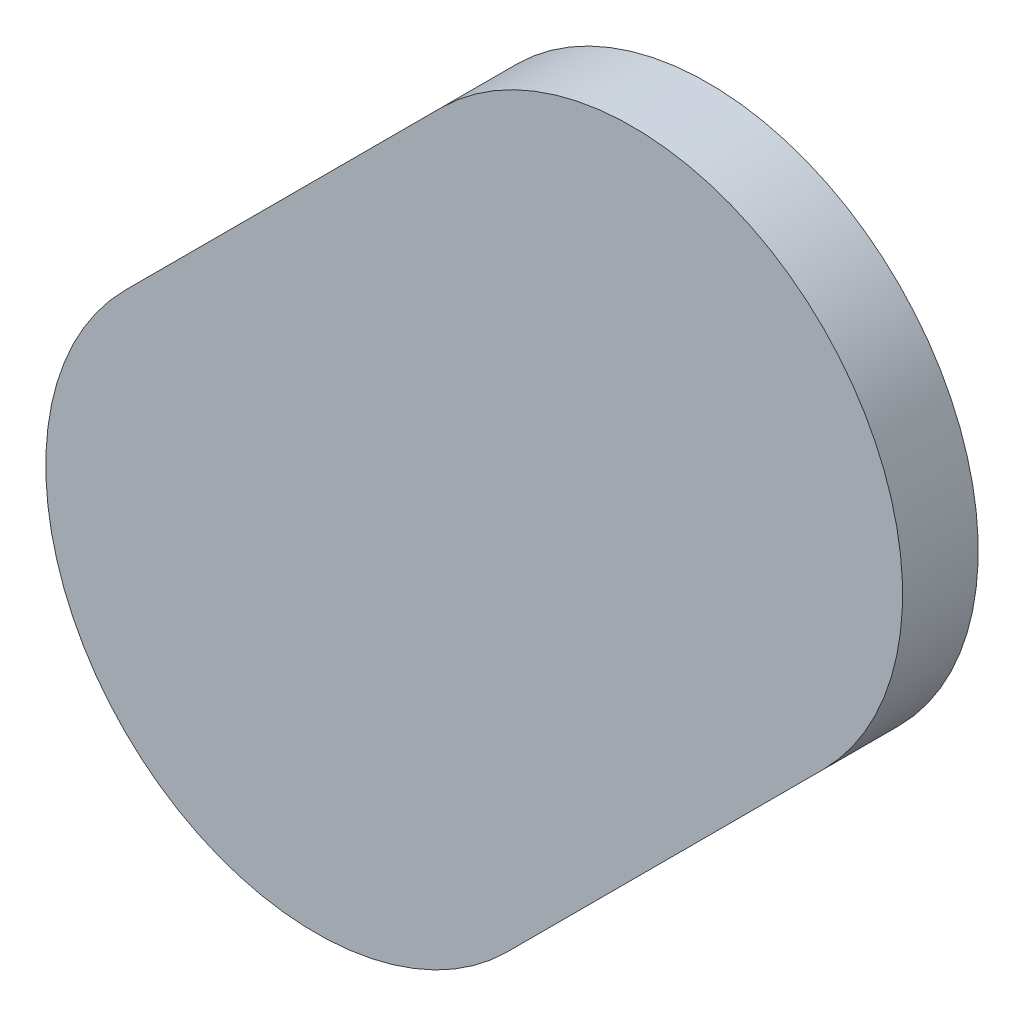
ISO-10303-21;
HEADER;
FILE_DESCRIPTION(('STEP AP214'),'2;1');
FILE_NAME('part.step','',(''),(''),'','','');
FILE_SCHEMA(('AUTOMOTIVE_DESIGN { 1 0 10303 214 1 1 1 1 }'));
ENDSEC;
DATA;
#1=APPLICATION_CONTEXT('core data for automotive mechanical design processes');
#2=APPLICATION_PROTOCOL_DEFINITION('international standard','automotive_design',2000,#1);
#3=PRODUCT_CONTEXT('',#1,'mechanical');
#4=PRODUCT('Part','Part','',(#3));
#5=PRODUCT_RELATED_PRODUCT_CATEGORY('part','',(#4));
#6=PRODUCT_DEFINITION_FORMATION('','',#4);
#7=PRODUCT_DEFINITION_CONTEXT('part definition',#1,'design');
#8=PRODUCT_DEFINITION('design','',#6,#7);
#9=PRODUCT_DEFINITION_SHAPE('','',#8);
#10=(LENGTH_UNIT() NAMED_UNIT(*) SI_UNIT(.MILLI.,.METRE.));
#11=(NAMED_UNIT(*) PLANE_ANGLE_UNIT() SI_UNIT($,.RADIAN.));
#12=(NAMED_UNIT(*) SI_UNIT($,.STERADIAN.) SOLID_ANGLE_UNIT());
#13=UNCERTAINTY_MEASURE_WITH_UNIT(LENGTH_MEASURE(1.E-05),#10,'distance_accuracy_value','');
#14=(GEOMETRIC_REPRESENTATION_CONTEXT(3) GLOBAL_UNCERTAINTY_ASSIGNED_CONTEXT((#13)) GLOBAL_UNIT_ASSIGNED_CONTEXT((#10,
#11,#12)) REPRESENTATION_CONTEXT('',''));
#15=CARTESIAN_POINT('',(0.,0.,0.));
#16=DIRECTION('',(0.,0.,1.));
#17=DIRECTION('',(1.,0.,0.));
#18=AXIS2_PLACEMENT_3D('',#15,#16,#17);
#19=CARTESIAN_POINT('',(79.606775,94.04837934,0.));
#20=DIRECTION('',(-0.707100745612045,0.707112816709534,0.));
#21=DIRECTION('',(0.707112816709534,0.707100745612045,0.));
#22=AXIS2_PLACEMENT_3D('',#19,#20,#21);
#23=PLANE('',#22);
#24=DIRECTION('',(0.707112816709534,0.707100745612044,0.));
#25=VECTOR('',#24,1.);
#26=CARTESIAN_POINT('',(79.606775,94.04837934,0.03556));
#27=LINE('',#26,#25);
#28=CARTESIAN_POINT('',(79.606775,94.04837934,0.03556));
#29=VERTEX_POINT('',#28);
#30=CARTESIAN_POINT('',(79.75556566,94.19716746,0.03556));
#31=VERTEX_POINT('',#30);
#32=EDGE_CURVE('E11',#29,#31,#27,.T.);
#33=ORIENTED_EDGE('',*,*,#32,.F.);
#34=DIRECTION('',(0.,0.,1.));
#35=VECTOR('',#34,1.);
#36=CARTESIAN_POINT('',(79.606775,94.04837934,0.));
#37=LINE('',#36,#35);
#38=CARTESIAN_POINT('',(79.606775,94.04837934,0.));
#39=VERTEX_POINT('',#38);
#40=EDGE_CURVE('E24',#39,#29,#37,.T.);
#41=ORIENTED_EDGE('',*,*,#40,.F.);
#42=DIRECTION('',(0.707112816709534,0.707100745612044,0.));
#43=VECTOR('',#42,1.);
#44=CARTESIAN_POINT('',(79.606775,94.04837934,0.));
#45=LINE('',#44,#43);
#46=CARTESIAN_POINT('',(79.75556566,94.19716746,0.));
#47=VERTEX_POINT('',#46);
#48=EDGE_CURVE('E75',#39,#47,#45,.T.);
#49=ORIENTED_EDGE('',*,*,#48,.T.);
#50=DIRECTION('',(0.,0.,1.));
#51=VECTOR('',#50,1.);
#52=CARTESIAN_POINT('',(79.75556566,94.19716746,0.));
#53=LINE('',#52,#51);
#54=EDGE_CURVE('E37',#47,#31,#53,.T.);
#55=ORIENTED_EDGE('',*,*,#54,.T.);
#56=EDGE_LOOP('',(#33,#41,#49,#55));
#57=FACE_BOUND('',#56,.T.);
#58=ADVANCED_FACE('F17',(#57),#23,.F.);
#59=CARTESIAN_POINT('',(79.66576269,94.28697043,0.));
#60=DIRECTION('',(0.,0.,-1.));
#61=DIRECTION('',(0.707106781186492,-0.707106781186604,0.));
#62=AXIS2_PLACEMENT_3D('',#59,#60,#61);
#63=CYLINDRICAL_SURFACE('',#62,0.127000578115382);
#64=CARTESIAN_POINT('',(79.66576269,94.28697043,0.03556));
#65=DIRECTION('',(0.,0.,1.));
#66=DIRECTION('',(0.707106781186492,-0.707106781186604,0.));
#67=AXIS2_PLACEMENT_3D('',#64,#65,#66);
#68=CIRCLE('',#67,0.127000578115382);
#69=CARTESIAN_POINT('',(79.57595972,94.3767734,0.03556));
#70=VERTEX_POINT('',#69);
#71=EDGE_CURVE('E83',#31,#70,#68,.T.);
#72=ORIENTED_EDGE('',*,*,#71,.F.);
#73=ORIENTED_EDGE('',*,*,#54,.F.);
#74=CARTESIAN_POINT('',(79.66576269,94.28697043,0.));
#75=DIRECTION('',(0.,0.,1.));
#76=DIRECTION('',(0.707106781186492,-0.707106781186604,0.));
#77=AXIS2_PLACEMENT_3D('',#74,#75,#76);
#78=CIRCLE('',#77,0.127000578115382);
#79=CARTESIAN_POINT('',(79.57595972,94.3767734,0.));
#80=VERTEX_POINT('',#79);
#81=EDGE_CURVE('E81',#47,#80,#78,.T.);
#82=ORIENTED_EDGE('',*,*,#81,.T.);
#83=DIRECTION('',(0.,0.,1.));
#84=VECTOR('',#83,1.);
#85=CARTESIAN_POINT('',(79.57595972,94.3767734,0.));
#86=LINE('',#85,#84);
#87=EDGE_CURVE('E67',#80,#70,#86,.T.);
#88=ORIENTED_EDGE('',*,*,#87,.T.);
#89=EDGE_LOOP('',(#72,#73,#82,#88));
#90=FACE_BOUND('',#89,.T.);
#91=ADVANCED_FACE('F89',(#90),#63,.T.);
#92=CARTESIAN_POINT('',(79.57595972,94.3767734,0.));
#93=DIRECTION('',(0.7071128167095,-0.707100745612078,0.));
#94=DIRECTION('',(-0.707100745612078,-0.7071128167095,0.));
#95=AXIS2_PLACEMENT_3D('',#92,#93,#94);
#96=PLANE('',#95);
#97=DIRECTION('',(-0.707100745612078,-0.7071128167095,0.));
#98=VECTOR('',#97,1.);
#99=CARTESIAN_POINT('',(79.57595972,94.3767734,0.03556));
#100=LINE('',#99,#98);
#101=CARTESIAN_POINT('',(79.4271716,94.22798274,0.03556));
#102=VERTEX_POINT('',#101);
#103=EDGE_CURVE('E71',#70,#102,#100,.T.);
#104=ORIENTED_EDGE('',*,*,#103,.F.);
#105=ORIENTED_EDGE('',*,*,#87,.F.);
#106=DIRECTION('',(-0.707100745612078,-0.7071128167095,0.));
#107=VECTOR('',#106,1.);
#108=CARTESIAN_POINT('',(79.57595972,94.3767734,0.));
#109=LINE('',#108,#107);
#110=CARTESIAN_POINT('',(79.4271716,94.22798274,0.));
#111=VERTEX_POINT('',#110);
#112=EDGE_CURVE('E63',#80,#111,#109,.T.);
#113=ORIENTED_EDGE('',*,*,#112,.T.);
#114=DIRECTION('',(0.,0.,1.));
#115=VECTOR('',#114,1.);
#116=CARTESIAN_POINT('',(79.4271716,94.22798274,0.));
#117=LINE('',#116,#115);
#118=EDGE_CURVE('E53',#111,#102,#117,.T.);
#119=ORIENTED_EDGE('',*,*,#118,.T.);
#120=EDGE_LOOP('',(#104,#105,#113,#119));
#121=FACE_BOUND('',#120,.T.);
#122=ADVANCED_FACE('F66',(#121),#96,.F.);
#123=CARTESIAN_POINT('',(79.5169733,94.13818104,0.));
#124=DIRECTION('',(0.,0.,-1.));
#125=DIRECTION('',(-0.707106781186548,0.707106781186548,0.));
#126=AXIS2_PLACEMENT_3D('',#123,#124,#125);
#127=CYLINDRICAL_SURFACE('',#126,0.12699878206416);
#128=CARTESIAN_POINT('',(79.5169733,94.13818104,0.03556));
#129=DIRECTION('',(0.,0.,1.));
#130=DIRECTION('',(-0.707106781186548,0.707106781186548,0.));
#131=AXIS2_PLACEMENT_3D('',#128,#129,#130);
#132=CIRCLE('',#131,0.12699878206416);
#133=EDGE_CURVE('E59',#102,#29,#132,.T.);
#134=ORIENTED_EDGE('',*,*,#133,.F.);
#135=ORIENTED_EDGE('',*,*,#118,.F.);
#136=CARTESIAN_POINT('',(79.5169733,94.13818104,0.));
#137=DIRECTION('',(0.,0.,1.));
#138=DIRECTION('',(-0.707106781186548,0.707106781186548,0.));
#139=AXIS2_PLACEMENT_3D('',#136,#137,#138);
#140=CIRCLE('',#139,0.12699878206416);
#141=EDGE_CURVE('E57',#111,#39,#140,.T.);
#142=ORIENTED_EDGE('',*,*,#141,.T.);
#143=ORIENTED_EDGE('',*,*,#40,.T.);
#144=EDGE_LOOP('',(#134,#135,#142,#143));
#145=FACE_BOUND('',#144,.T.);
#146=ADVANCED_FACE('F55',(#145),#127,.T.);
#147=CARTESIAN_POINT('',(79.606775,94.04837934,0.));
#148=DIRECTION('',(0.,0.,-1.));
#149=DIRECTION('',(-1.,0.,0.));
#150=AXIS2_PLACEMENT_3D('',#147,#148,#149);
#151=PLANE('',#150);
#152=ORIENTED_EDGE('',*,*,#141,.F.);
#153=ORIENTED_EDGE('',*,*,#112,.F.);
#154=ORIENTED_EDGE('',*,*,#81,.F.);
#155=ORIENTED_EDGE('',*,*,#48,.F.);
#156=EDGE_LOOP('',(#152,#153,#154,#155));
#157=FACE_BOUND('',#156,.T.);
#158=ADVANCED_FACE('F74',(#157),#151,.T.);
#159=CARTESIAN_POINT('',(79.606775,94.04837934,0.03556));
#160=DIRECTION('',(0.,0.,-1.));
#161=DIRECTION('',(-1.,0.,0.));
#162=AXIS2_PLACEMENT_3D('',#159,#160,#161);
#163=PLANE('',#162);
#164=ORIENTED_EDGE('',*,*,#32,.T.);
#165=ORIENTED_EDGE('',*,*,#71,.T.);
#166=ORIENTED_EDGE('',*,*,#103,.T.);
#167=ORIENTED_EDGE('',*,*,#133,.T.);
#168=EDGE_LOOP('',(#164,#165,#166,#167));
#169=FACE_BOUND('',#168,.T.);
#170=ADVANCED_FACE('F91',(#169),#163,.F.);
#171=CLOSED_SHELL('',(#58,#91,#122,#146,#158,#170));
#172=MANIFOLD_SOLID_BREP('B1',#171);
#173=ADVANCED_BREP_SHAPE_REPRESENTATION('',(#18,#172),#14);
#174=SHAPE_DEFINITION_REPRESENTATION(#9,#173);
ENDSEC;
END-ISO-10303-21;
